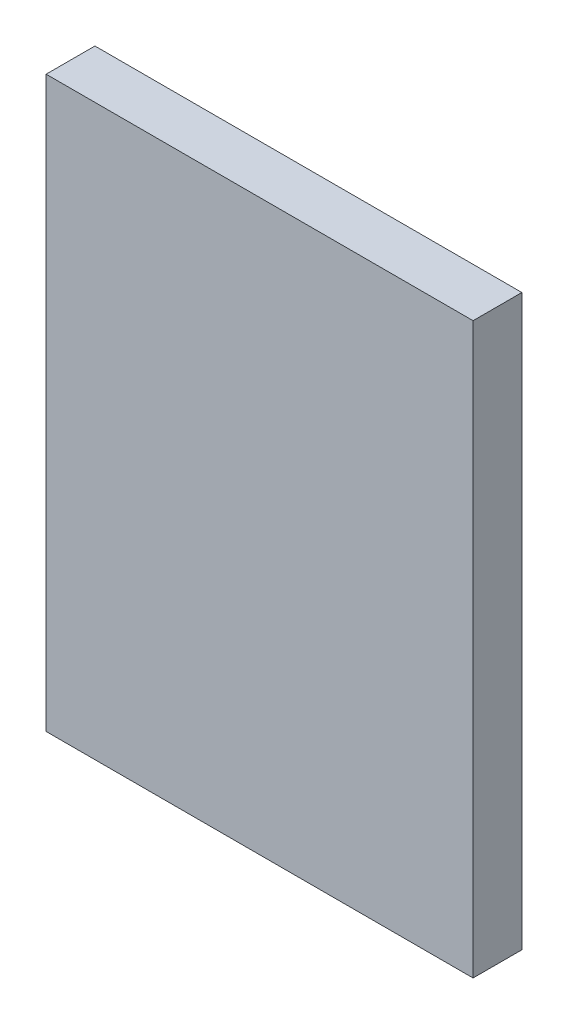
ISO-10303-21;
HEADER;
FILE_DESCRIPTION(('STEP AP214'),'2;1');
FILE_NAME('part.step','',(''),(''),'','','');
FILE_SCHEMA(('AUTOMOTIVE_DESIGN { 1 0 10303 214 1 1 1 1 }'));
ENDSEC;
DATA;
#1=APPLICATION_CONTEXT('core data for automotive mechanical design processes');
#2=APPLICATION_PROTOCOL_DEFINITION('international standard','automotive_design',2000,#1);
#3=PRODUCT_CONTEXT('',#1,'mechanical');
#4=PRODUCT('Part','Part','',(#3));
#5=PRODUCT_RELATED_PRODUCT_CATEGORY('part','',(#4));
#6=PRODUCT_DEFINITION_FORMATION('','',#4);
#7=PRODUCT_DEFINITION_CONTEXT('part definition',#1,'design');
#8=PRODUCT_DEFINITION('design','',#6,#7);
#9=PRODUCT_DEFINITION_SHAPE('','',#8);
#10=(LENGTH_UNIT() NAMED_UNIT(*) SI_UNIT(.MILLI.,.METRE.));
#11=(NAMED_UNIT(*) PLANE_ANGLE_UNIT() SI_UNIT($,.RADIAN.));
#12=(NAMED_UNIT(*) SI_UNIT($,.STERADIAN.) SOLID_ANGLE_UNIT());
#13=UNCERTAINTY_MEASURE_WITH_UNIT(LENGTH_MEASURE(1.E-05),#10,'distance_accuracy_value','');
#14=(GEOMETRIC_REPRESENTATION_CONTEXT(3) GLOBAL_UNCERTAINTY_ASSIGNED_CONTEXT((#13)) GLOBAL_UNIT_ASSIGNED_CONTEXT((#10,
#11,#12)) REPRESENTATION_CONTEXT('',''));
#15=CARTESIAN_POINT('',(0.,0.,0.));
#16=DIRECTION('',(0.,0.,1.));
#17=DIRECTION('',(1.,0.,0.));
#18=AXIS2_PLACEMENT_3D('',#15,#16,#17);
#19=CARTESIAN_POINT('',(8.245,2.8829,0.76487));
#20=DIRECTION('',(0.,0.,-1.));
#21=DIRECTION('',(-1.,0.,0.));
#22=AXIS2_PLACEMENT_3D('',#19,#20,#21);
#23=PLANE('',#22);
#24=DIRECTION('',(1.,0.,0.));
#25=VECTOR('',#24,1.);
#26=CARTESIAN_POINT('',(8.095,3.0829,0.76487));
#27=LINE('',#26,#25);
#28=CARTESIAN_POINT('',(8.095,3.0829,0.76487));
#29=VERTEX_POINT('',#28);
#30=CARTESIAN_POINT('',(8.395,3.0829,0.76487));
#31=VERTEX_POINT('',#30);
#32=EDGE_CURVE('E55',#29,#31,#27,.T.);
#33=ORIENTED_EDGE('',*,*,#32,.T.);
#34=DIRECTION('',(0.,1.,0.));
#35=VECTOR('',#34,1.);
#36=CARTESIAN_POINT('',(8.395,3.0829,0.76487));
#37=LINE('',#36,#35);
#38=CARTESIAN_POINT('',(8.395,2.6829,0.76487));
#39=VERTEX_POINT('',#38);
#40=EDGE_CURVE('E57',#31,#39,#37,.F.);
#41=ORIENTED_EDGE('',*,*,#40,.T.);
#42=DIRECTION('',(1.,0.,0.));
#43=VECTOR('',#42,1.);
#44=CARTESIAN_POINT('',(8.395,2.6829,0.76487));
#45=LINE('',#44,#43);
#46=CARTESIAN_POINT('',(8.095,2.6829,0.76487));
#47=VERTEX_POINT('',#46);
#48=EDGE_CURVE('E20',#39,#47,#45,.F.);
#49=ORIENTED_EDGE('',*,*,#48,.T.);
#50=DIRECTION('',(0.,1.,0.));
#51=VECTOR('',#50,1.);
#52=CARTESIAN_POINT('',(8.095,2.6829,0.76487));
#53=LINE('',#52,#51);
#54=EDGE_CURVE('E80',#47,#29,#53,.T.);
#55=ORIENTED_EDGE('',*,*,#54,.T.);
#56=EDGE_LOOP('',(#33,#41,#49,#55));
#57=FACE_BOUND('',#56,.T.);
#58=ADVANCED_FACE('F17',(#57),#23,.T.);
#59=CARTESIAN_POINT('',(8.395,2.6829,0.76487));
#60=DIRECTION('',(0.,1.,0.));
#61=DIRECTION('',(0.,0.,1.));
#62=AXIS2_PLACEMENT_3D('',#59,#60,#61);
#63=PLANE('',#62);
#64=DIRECTION('',(0.,0.,1.));
#65=VECTOR('',#64,1.);
#66=CARTESIAN_POINT('',(8.095,2.6829,0.76487));
#67=LINE('',#66,#65);
#68=CARTESIAN_POINT('',(8.095,2.6829,0.79916));
#69=VERTEX_POINT('',#68);
#70=EDGE_CURVE('E68',#69,#47,#67,.F.);
#71=ORIENTED_EDGE('',*,*,#70,.T.);
#72=ORIENTED_EDGE('',*,*,#48,.F.);
#73=DIRECTION('',(0.,0.,1.));
#74=VECTOR('',#73,1.);
#75=CARTESIAN_POINT('',(8.395,2.6829,0.76487));
#76=LINE('',#75,#74);
#77=CARTESIAN_POINT('',(8.395,2.6829,0.79916));
#78=VERTEX_POINT('',#77);
#79=EDGE_CURVE('E63',#39,#78,#76,.T.);
#80=ORIENTED_EDGE('',*,*,#79,.T.);
#81=DIRECTION('',(1.,0.,0.));
#82=VECTOR('',#81,1.);
#83=CARTESIAN_POINT('',(8.245,2.6829,0.79916));
#84=LINE('',#83,#82);
#85=EDGE_CURVE('E83',#69,#78,#84,.T.);
#86=ORIENTED_EDGE('',*,*,#85,.F.);
#87=EDGE_LOOP('',(#71,#72,#80,#86));
#88=FACE_BOUND('',#87,.T.);
#89=ADVANCED_FACE('F65',(#88),#63,.F.);
#90=CARTESIAN_POINT('',(8.395,3.0829,0.76487));
#91=DIRECTION('',(-1.,0.,0.));
#92=DIRECTION('',(0.,0.,1.));
#93=AXIS2_PLACEMENT_3D('',#90,#91,#92);
#94=PLANE('',#93);
#95=ORIENTED_EDGE('',*,*,#79,.F.);
#96=ORIENTED_EDGE('',*,*,#40,.F.);
#97=DIRECTION('',(0.,0.,-1.));
#98=VECTOR('',#97,1.);
#99=CARTESIAN_POINT('',(8.395,3.0829,0.76487));
#100=LINE('',#99,#98);
#101=CARTESIAN_POINT('',(8.395,3.0829,0.79916));
#102=VERTEX_POINT('',#101);
#103=EDGE_CURVE('E75',#31,#102,#100,.F.);
#104=ORIENTED_EDGE('',*,*,#103,.T.);
#105=DIRECTION('',(0.,-1.,0.));
#106=VECTOR('',#105,1.);
#107=CARTESIAN_POINT('',(8.395,2.8829,0.79916));
#108=LINE('',#107,#106);
#109=EDGE_CURVE('E72',#78,#102,#108,.F.);
#110=ORIENTED_EDGE('',*,*,#109,.F.);
#111=EDGE_LOOP('',(#95,#96,#104,#110));
#112=FACE_BOUND('',#111,.T.);
#113=ADVANCED_FACE('F70',(#112),#94,.F.);
#114=CARTESIAN_POINT('',(8.095,3.0829,0.76487));
#115=DIRECTION('',(0.,-1.,0.));
#116=DIRECTION('',(0.,0.,-1.));
#117=AXIS2_PLACEMENT_3D('',#114,#115,#116);
#118=PLANE('',#117);
#119=ORIENTED_EDGE('',*,*,#103,.F.);
#120=ORIENTED_EDGE('',*,*,#32,.F.);
#121=DIRECTION('',(0.,0.,1.));
#122=VECTOR('',#121,1.);
#123=CARTESIAN_POINT('',(8.095,3.0829,0.76487));
#124=LINE('',#123,#122);
#125=CARTESIAN_POINT('',(8.095,3.0829,0.79916));
#126=VERTEX_POINT('',#125);
#127=EDGE_CURVE('E35',#29,#126,#124,.T.);
#128=ORIENTED_EDGE('',*,*,#127,.T.);
#129=DIRECTION('',(1.,0.,0.));
#130=VECTOR('',#129,1.);
#131=CARTESIAN_POINT('',(8.245,3.0829,0.79916));
#132=LINE('',#131,#130);
#133=EDGE_CURVE('E26',#102,#126,#132,.F.);
#134=ORIENTED_EDGE('',*,*,#133,.F.);
#135=EDGE_LOOP('',(#119,#120,#128,#134));
#136=FACE_BOUND('',#135,.T.);
#137=ADVANCED_FACE('F89',(#136),#118,.F.);
#138=CARTESIAN_POINT('',(8.095,2.6829,0.76487));
#139=DIRECTION('',(1.,0.,0.));
#140=DIRECTION('',(0.,1.,0.));
#141=AXIS2_PLACEMENT_3D('',#138,#139,#140);
#142=PLANE('',#141);
#143=ORIENTED_EDGE('',*,*,#127,.F.);
#144=ORIENTED_EDGE('',*,*,#54,.F.);
#145=ORIENTED_EDGE('',*,*,#70,.F.);
#146=DIRECTION('',(0.,-1.,0.));
#147=VECTOR('',#146,1.);
#148=CARTESIAN_POINT('',(8.095,2.8829,0.79916));
#149=LINE('',#148,#147);
#150=EDGE_CURVE('E11',#126,#69,#149,.T.);
#151=ORIENTED_EDGE('',*,*,#150,.F.);
#152=EDGE_LOOP('',(#143,#144,#145,#151));
#153=FACE_BOUND('',#152,.T.);
#154=ADVANCED_FACE('F91',(#153),#142,.F.);
#155=CARTESIAN_POINT('',(8.245,2.8829,0.79916));
#156=DIRECTION('',(0.,0.,1.));
#157=DIRECTION('',(0.,-1.,0.));
#158=AXIS2_PLACEMENT_3D('',#155,#156,#157);
#159=PLANE('',#158);
#160=ORIENTED_EDGE('',*,*,#133,.T.);
#161=ORIENTED_EDGE('',*,*,#150,.T.);
#162=ORIENTED_EDGE('',*,*,#85,.T.);
#163=ORIENTED_EDGE('',*,*,#109,.T.);
#164=EDGE_LOOP('',(#160,#161,#162,#163));
#165=FACE_BOUND('',#164,.T.);
#166=ADVANCED_FACE('F88',(#165),#159,.T.);
#167=CLOSED_SHELL('',(#58,#89,#113,#137,#154,#166));
#168=MANIFOLD_SOLID_BREP('B1',#167);
#169=ADVANCED_BREP_SHAPE_REPRESENTATION('',(#18,#168),#14);
#170=SHAPE_DEFINITION_REPRESENTATION(#9,#169);
ENDSEC;
END-ISO-10303-21;
